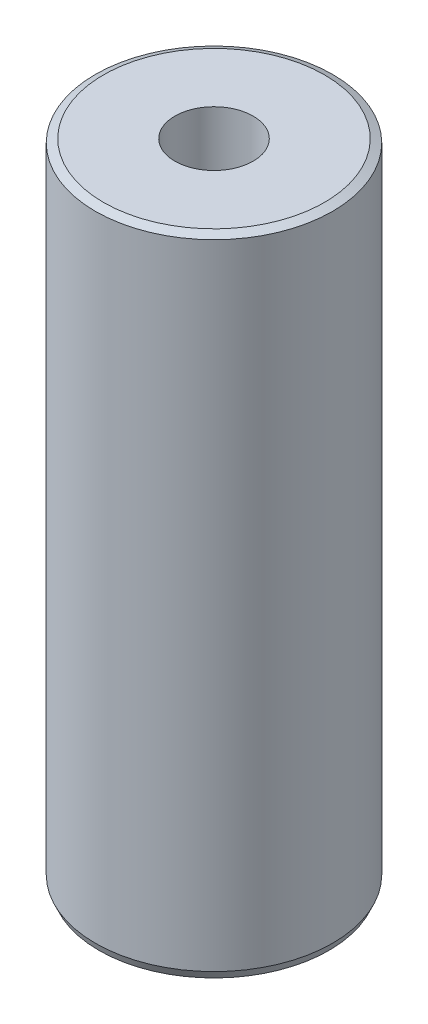
ISO-10303-21;
HEADER;
FILE_DESCRIPTION(('STEP AP214'),'2;1');
FILE_NAME('part.step','',(''),(''),'','','');
FILE_SCHEMA(('AUTOMOTIVE_DESIGN { 1 0 10303 214 1 1 1 1 }'));
ENDSEC;
DATA;
#1=APPLICATION_CONTEXT('core data for automotive mechanical design processes');
#2=APPLICATION_PROTOCOL_DEFINITION('international standard','automotive_design',2000,#1);
#3=PRODUCT_CONTEXT('',#1,'mechanical');
#4=PRODUCT('Part','Part','',(#3));
#5=PRODUCT_RELATED_PRODUCT_CATEGORY('part','',(#4));
#6=PRODUCT_DEFINITION_FORMATION('','',#4);
#7=PRODUCT_DEFINITION_CONTEXT('part definition',#1,'design');
#8=PRODUCT_DEFINITION('design','',#6,#7);
#9=PRODUCT_DEFINITION_SHAPE('','',#8);
#10=(LENGTH_UNIT() NAMED_UNIT(*) SI_UNIT(.MILLI.,.METRE.));
#11=(NAMED_UNIT(*) PLANE_ANGLE_UNIT() SI_UNIT($,.RADIAN.));
#12=(NAMED_UNIT(*) SI_UNIT($,.STERADIAN.) SOLID_ANGLE_UNIT());
#13=UNCERTAINTY_MEASURE_WITH_UNIT(LENGTH_MEASURE(1.E-05),#10,'distance_accuracy_value','');
#14=(GEOMETRIC_REPRESENTATION_CONTEXT(3) GLOBAL_UNCERTAINTY_ASSIGNED_CONTEXT((#13)) GLOBAL_UNIT_ASSIGNED_CONTEXT((#10,
#11,#12)) REPRESENTATION_CONTEXT('',''));
#15=CARTESIAN_POINT('',(0.,0.,0.));
#16=DIRECTION('',(0.,0.,1.));
#17=DIRECTION('',(1.,0.,0.));
#18=AXIS2_PLACEMENT_3D('',#15,#16,#17);
#19=CARTESIAN_POINT('',(0.,326.559223291344,0.));
#20=DIRECTION('',(0.,-1.,0.));
#21=DIRECTION('',(0.,0.,-1.));
#22=AXIS2_PLACEMENT_3D('',#19,#20,#21);
#23=CYLINDRICAL_SURFACE('',#22,60.);
#24=CARTESIAN_POINT('',(0.,324.709159326533,0.));
#25=DIRECTION('',(0.,1.,0.));
#26=DIRECTION('',(0.,0.,1.));
#27=AXIS2_PLACEMENT_3D('',#24,#25,#26);
#28=CIRCLE('',#27,60.);
#29=CARTESIAN_POINT('',(0.,324.709159326533,60.));
#30=VERTEX_POINT('',#29);
#31=EDGE_CURVE('E50',#30,#30,#28,.F.);
#32=ORIENTED_EDGE('',*,*,#31,.T.);
#33=EDGE_LOOP('',(#32));
#34=FACE_BOUND('',#33,.T.);
#35=CARTESIAN_POINT('',(0.,4.10707559848322,0.));
#36=DIRECTION('',(0.,1.,0.));
#37=DIRECTION('',(0.,0.,1.));
#38=AXIS2_PLACEMENT_3D('',#35,#36,#37);
#39=CIRCLE('',#38,60.);
#40=CARTESIAN_POINT('',(0.,4.10707559848322,60.));
#41=VERTEX_POINT('',#40);
#42=EDGE_CURVE('E51',#41,#41,#39,.T.);
#43=ORIENTED_EDGE('',*,*,#42,.T.);
#44=EDGE_LOOP('',(#43));
#45=FACE_BOUND('',#44,.T.);
#46=ADVANCED_FACE('F39',(#34,#45),#23,.T.);
#47=CARTESIAN_POINT('',(0.,326.559223291344,0.));
#48=DIRECTION('',(0.,1.,0.));
#49=DIRECTION('',(0.,0.,1.));
#50=AXIS2_PLACEMENT_3D('',#47,#48,#49);
#51=PLANE('',#50);
#52=CARTESIAN_POINT('',(0.,326.559223291344,0.));
#53=DIRECTION('',(0.,1.,0.));
#54=DIRECTION('',(0.,0.,1.));
#55=AXIS2_PLACEMENT_3D('',#52,#53,#54);
#56=CIRCLE('',#55,55.8929244015164);
#57=CARTESIAN_POINT('',(0.,326.559223291344,55.8929244015164));
#58=VERTEX_POINT('',#57);
#59=EDGE_CURVE('E54',#58,#58,#56,.T.);
#60=ORIENTED_EDGE('',*,*,#59,.T.);
#61=EDGE_LOOP('',(#60));
#62=FACE_BOUND('',#61,.T.);
#63=CARTESIAN_POINT('',(0.,326.559223291344,0.));
#64=DIRECTION('',(0.,1.,0.));
#65=DIRECTION('',(0.,0.,1.));
#66=AXIS2_PLACEMENT_3D('',#63,#64,#65);
#67=CIRCLE('',#66,19.7878775834096);
#68=CARTESIAN_POINT('',(0.,326.559223291344,19.7878775834096));
#69=VERTEX_POINT('',#68);
#70=EDGE_CURVE('E58',#69,#69,#67,.T.);
#71=ORIENTED_EDGE('',*,*,#70,.F.);
#72=EDGE_LOOP('',(#71));
#73=FACE_BOUND('',#72,.T.);
#74=ADVANCED_FACE('F69',(#62,#73),#51,.T.);
#75=CARTESIAN_POINT('',(0.,0.,0.));
#76=DIRECTION('',(0.,1.,0.));
#77=DIRECTION('',(0.,0.,1.));
#78=AXIS2_PLACEMENT_3D('',#75,#76,#77);
#79=PLANE('',#78);
#80=CARTESIAN_POINT('',(0.,0.,0.));
#81=DIRECTION('',(0.,1.,0.));
#82=DIRECTION('',(0.,0.,1.));
#83=AXIS2_PLACEMENT_3D('',#80,#81,#82);
#84=CIRCLE('',#83,58.1499360351891);
#85=CARTESIAN_POINT('',(0.,0.,58.1499360351891));
#86=VERTEX_POINT('',#85);
#87=EDGE_CURVE('E10',#86,#86,#84,.F.);
#88=ORIENTED_EDGE('',*,*,#87,.T.);
#89=EDGE_LOOP('',(#88));
#90=FACE_BOUND('',#89,.T.);
#91=CARTESIAN_POINT('',(0.,0.,0.));
#92=DIRECTION('',(0.,1.,0.));
#93=DIRECTION('',(0.,0.,1.));
#94=AXIS2_PLACEMENT_3D('',#91,#92,#93);
#95=CIRCLE('',#94,19.7878775834096);
#96=CARTESIAN_POINT('',(0.,0.,19.7878775834096));
#97=VERTEX_POINT('',#96);
#98=EDGE_CURVE('E63',#97,#97,#95,.T.);
#99=ORIENTED_EDGE('',*,*,#98,.T.);
#100=EDGE_LOOP('',(#99));
#101=FACE_BOUND('',#100,.T.);
#102=ADVANCED_FACE('F75',(#90,#101),#79,.F.);
#103=CARTESIAN_POINT('',(0.,326.559223291344,0.));
#104=DIRECTION('',(0.,-1.,0.));
#105=DIRECTION('',(0.,0.,-1.));
#106=AXIS2_PLACEMENT_3D('',#103,#104,#105);
#107=CYLINDRICAL_SURFACE('',#106,19.7878775834096);
#108=ORIENTED_EDGE('',*,*,#70,.T.);
#109=EDGE_LOOP('',(#108));
#110=FACE_BOUND('',#109,.T.);
#111=ORIENTED_EDGE('',*,*,#98,.F.);
#112=EDGE_LOOP('',(#111));
#113=FACE_BOUND('',#112,.T.);
#114=ADVANCED_FACE('F70',(#110,#113),#107,.F.);
#115=CARTESIAN_POINT('',(0.,326.559223291344,0.));
#116=DIRECTION('',(0.,-1.,0.));
#117=DIRECTION('',(0.,0.,-1.));
#118=AXIS2_PLACEMENT_3D('',#115,#116,#117);
#119=CONICAL_SURFACE('',#118,55.8929244015164,1.14756181443337);
#120=ORIENTED_EDGE('',*,*,#31,.F.);
#121=EDGE_LOOP('',(#120));
#122=FACE_BOUND('',#121,.T.);
#123=ORIENTED_EDGE('',*,*,#59,.F.);
#124=EDGE_LOOP('',(#123));
#125=FACE_BOUND('',#124,.T.);
#126=ADVANCED_FACE('F81',(#122,#125),#119,.T.);
#127=CARTESIAN_POINT('',(0.,4.10707559848322,0.));
#128=DIRECTION('',(0.,1.,0.));
#129=DIRECTION('',(0.,0.,1.));
#130=AXIS2_PLACEMENT_3D('',#127,#128,#129);
#131=CONICAL_SURFACE('',#130,60.,0.423234512361517);
#132=ORIENTED_EDGE('',*,*,#87,.F.);
#133=EDGE_LOOP('',(#132));
#134=FACE_BOUND('',#133,.T.);
#135=ORIENTED_EDGE('',*,*,#42,.F.);
#136=EDGE_LOOP('',(#135));
#137=FACE_BOUND('',#136,.T.);
#138=ADVANCED_FACE('F45',(#134,#137),#131,.T.);
#139=CLOSED_SHELL('',(#46,#74,#102,#114,#126,#138));
#140=MANIFOLD_SOLID_BREP('B2',#139);
#141=ADVANCED_BREP_SHAPE_REPRESENTATION('',(#18,#140),#14);
#142=SHAPE_DEFINITION_REPRESENTATION(#9,#141);
ENDSEC;
END-ISO-10303-21;
